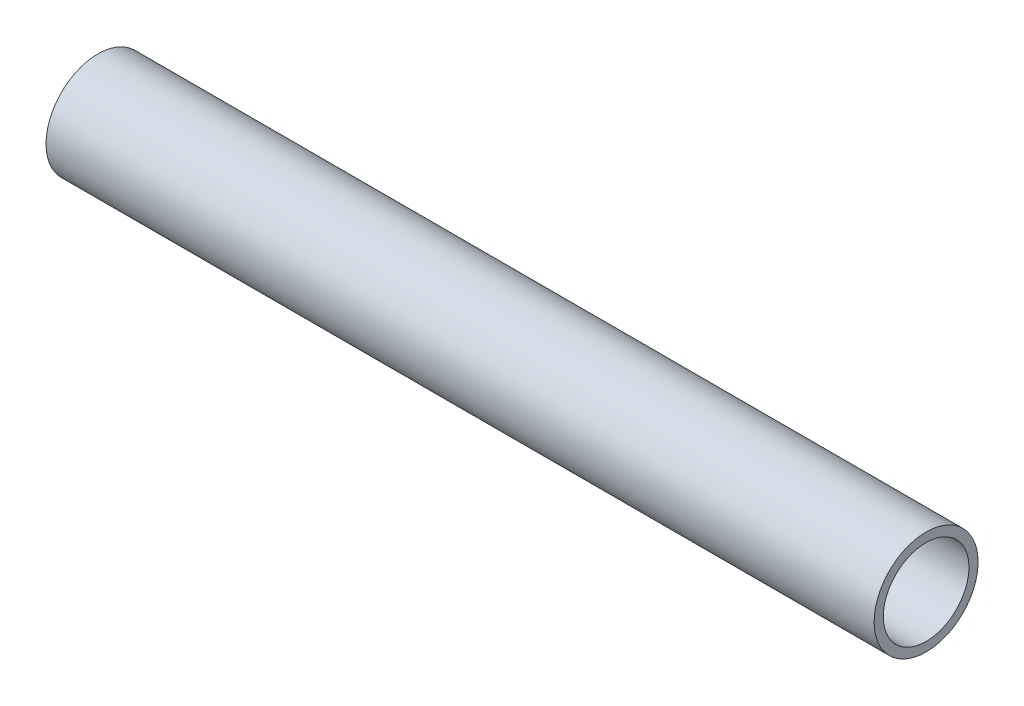
ISO-10303-21;
HEADER;
FILE_DESCRIPTION(('STEP AP214'),'2;1');
FILE_NAME('part.step','',(''),(''),'','','');
FILE_SCHEMA(('AUTOMOTIVE_DESIGN { 1 0 10303 214 1 1 1 1 }'));
ENDSEC;
DATA;
#1=APPLICATION_CONTEXT('core data for automotive mechanical design processes');
#2=APPLICATION_PROTOCOL_DEFINITION('international standard','automotive_design',2000,#1);
#3=PRODUCT_CONTEXT('',#1,'mechanical');
#4=PRODUCT('Part','Part','',(#3));
#5=PRODUCT_RELATED_PRODUCT_CATEGORY('part','',(#4));
#6=PRODUCT_DEFINITION_FORMATION('','',#4);
#7=PRODUCT_DEFINITION_CONTEXT('part definition',#1,'design');
#8=PRODUCT_DEFINITION('design','',#6,#7);
#9=PRODUCT_DEFINITION_SHAPE('','',#8);
#10=(LENGTH_UNIT() NAMED_UNIT(*) SI_UNIT(.MILLI.,.METRE.));
#11=(NAMED_UNIT(*) PLANE_ANGLE_UNIT() SI_UNIT($,.RADIAN.));
#12=(NAMED_UNIT(*) SI_UNIT($,.STERADIAN.) SOLID_ANGLE_UNIT());
#13=UNCERTAINTY_MEASURE_WITH_UNIT(LENGTH_MEASURE(1.E-05),#10,'distance_accuracy_value','');
#14=(GEOMETRIC_REPRESENTATION_CONTEXT(3) GLOBAL_UNCERTAINTY_ASSIGNED_CONTEXT((#13)) GLOBAL_UNIT_ASSIGNED_CONTEXT((#10,
#11,#12)) REPRESENTATION_CONTEXT('',''));
#15=CARTESIAN_POINT('',(0.,0.,0.));
#16=DIRECTION('',(0.,0.,1.));
#17=DIRECTION('',(1.,0.,0.));
#18=AXIS2_PLACEMENT_3D('',#15,#16,#17);
#19=CARTESIAN_POINT('',(-154.700411065163,675.722707308606,0.));
#20=DIRECTION('',(1.,0.,0.));
#21=DIRECTION('',(0.,0.,-1.));
#22=AXIS2_PLACEMENT_3D('',#19,#20,#21);
#23=CYLINDRICAL_SURFACE('',#22,2.61620000000002);
#24=CARTESIAN_POINT('',(-154.700411065163,675.722707308606,0.));
#25=DIRECTION('',(-1.,0.,0.));
#26=DIRECTION('',(0.,0.,1.));
#27=AXIS2_PLACEMENT_3D('',#24,#25,#26);
#28=CIRCLE('',#27,2.61620000000002);
#29=CARTESIAN_POINT('',(-154.700411065163,675.722707308606,2.61620000000002));
#30=VERTEX_POINT('',#29);
#31=EDGE_CURVE('E44',#30,#30,#28,.T.);
#32=ORIENTED_EDGE('',*,*,#31,.T.);
#33=EDGE_LOOP('',(#32));
#34=FACE_BOUND('',#33,.T.);
#35=CARTESIAN_POINT('',(-104.128583281264,675.722707308606,0.));
#36=DIRECTION('',(-1.,0.,0.));
#37=DIRECTION('',(0.,0.,1.));
#38=AXIS2_PLACEMENT_3D('',#35,#36,#37);
#39=CIRCLE('',#38,2.61620000000002);
#40=CARTESIAN_POINT('',(-104.128583281264,675.722707308606,2.61620000000002));
#41=VERTEX_POINT('',#40);
#42=EDGE_CURVE('E50',#41,#41,#39,.T.);
#43=ORIENTED_EDGE('',*,*,#42,.F.);
#44=EDGE_LOOP('',(#43));
#45=FACE_BOUND('',#44,.T.);
#46=ADVANCED_FACE('F37',(#34,#45),#23,.F.);
#47=CARTESIAN_POINT('',(-154.700411065163,675.722707308606,0.));
#48=DIRECTION('',(1.,0.,0.));
#49=DIRECTION('',(0.,0.,-1.));
#50=AXIS2_PLACEMENT_3D('',#47,#48,#49);
#51=CYLINDRICAL_SURFACE('',#50,3.17499999999997);
#52=CARTESIAN_POINT('',(-154.700411065163,675.722707308606,0.));
#53=DIRECTION('',(-1.,0.,0.));
#54=DIRECTION('',(0.,0.,1.));
#55=AXIS2_PLACEMENT_3D('',#52,#53,#54);
#56=CIRCLE('',#55,3.17499999999997);
#57=CARTESIAN_POINT('',(-154.700411065163,675.722707308606,3.17499999999997));
#58=VERTEX_POINT('',#57);
#59=EDGE_CURVE('E11',#58,#58,#56,.T.);
#60=ORIENTED_EDGE('',*,*,#59,.F.);
#61=EDGE_LOOP('',(#60));
#62=FACE_BOUND('',#61,.T.);
#63=CARTESIAN_POINT('',(-104.128583281264,675.722707308606,0.));
#64=DIRECTION('',(-1.,0.,0.));
#65=DIRECTION('',(0.,0.,1.));
#66=AXIS2_PLACEMENT_3D('',#63,#64,#65);
#67=CIRCLE('',#66,3.17499999999997);
#68=CARTESIAN_POINT('',(-104.128583281264,675.722707308606,3.17499999999997));
#69=VERTEX_POINT('',#68);
#70=EDGE_CURVE('E40',#69,#69,#67,.T.);
#71=ORIENTED_EDGE('',*,*,#70,.T.);
#72=EDGE_LOOP('',(#71));
#73=FACE_BOUND('',#72,.T.);
#74=ADVANCED_FACE('F57',(#62,#73),#51,.T.);
#75=CARTESIAN_POINT('',(-154.700411065163,675.722707308606,0.));
#76=DIRECTION('',(-1.,0.,0.));
#77=DIRECTION('',(0.,0.,1.));
#78=AXIS2_PLACEMENT_3D('',#75,#76,#77);
#79=PLANE('',#78);
#80=ORIENTED_EDGE('',*,*,#31,.F.);
#81=EDGE_LOOP('',(#80));
#82=FACE_BOUND('',#81,.T.);
#83=ORIENTED_EDGE('',*,*,#59,.T.);
#84=EDGE_LOOP('',(#83));
#85=FACE_BOUND('',#84,.T.);
#86=ADVANCED_FACE('F61',(#82,#85),#79,.T.);
#87=CARTESIAN_POINT('',(-104.128583281264,675.722707308606,0.));
#88=DIRECTION('',(-1.,0.,0.));
#89=DIRECTION('',(0.,0.,1.));
#90=AXIS2_PLACEMENT_3D('',#87,#88,#89);
#91=PLANE('',#90);
#92=ORIENTED_EDGE('',*,*,#42,.T.);
#93=EDGE_LOOP('',(#92));
#94=FACE_BOUND('',#93,.T.);
#95=ORIENTED_EDGE('',*,*,#70,.F.);
#96=EDGE_LOOP('',(#95));
#97=FACE_BOUND('',#96,.T.);
#98=ADVANCED_FACE('F59',(#94,#97),#91,.F.);
#99=CLOSED_SHELL('',(#46,#74,#86,#98));
#100=MANIFOLD_SOLID_BREP('B2',#99);
#101=ADVANCED_BREP_SHAPE_REPRESENTATION('',(#18,#100),#14);
#102=SHAPE_DEFINITION_REPRESENTATION(#9,#101);
ENDSEC;
END-ISO-10303-21;
